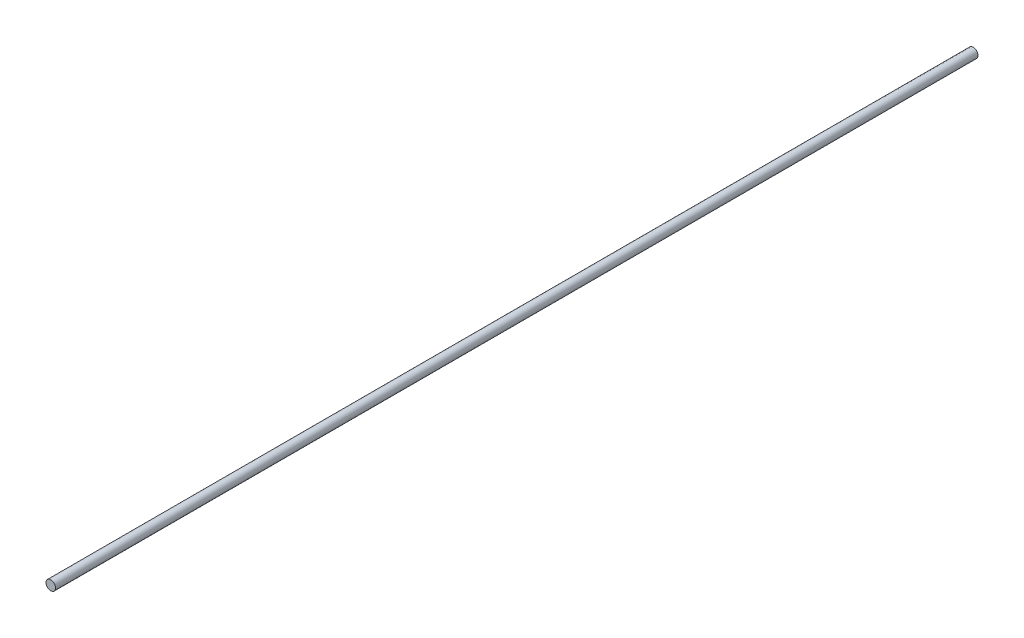
ISO-10303-21;
HEADER;
FILE_DESCRIPTION(('STEP AP214'),'2;1');
FILE_NAME('part.step','',(''),(''),'','','');
FILE_SCHEMA(('AUTOMOTIVE_DESIGN { 1 0 10303 214 1 1 1 1 }'));
ENDSEC;
DATA;
#1=APPLICATION_CONTEXT('core data for automotive mechanical design processes');
#2=APPLICATION_PROTOCOL_DEFINITION('international standard','automotive_design',2000,#1);
#3=PRODUCT_CONTEXT('',#1,'mechanical');
#4=PRODUCT('Part','Part','',(#3));
#5=PRODUCT_RELATED_PRODUCT_CATEGORY('part','',(#4));
#6=PRODUCT_DEFINITION_FORMATION('','',#4);
#7=PRODUCT_DEFINITION_CONTEXT('part definition',#1,'design');
#8=PRODUCT_DEFINITION('design','',#6,#7);
#9=PRODUCT_DEFINITION_SHAPE('','',#8);
#10=(LENGTH_UNIT() NAMED_UNIT(*) SI_UNIT(.MILLI.,.METRE.));
#11=(NAMED_UNIT(*) PLANE_ANGLE_UNIT() SI_UNIT($,.RADIAN.));
#12=(NAMED_UNIT(*) SI_UNIT($,.STERADIAN.) SOLID_ANGLE_UNIT());
#13=UNCERTAINTY_MEASURE_WITH_UNIT(LENGTH_MEASURE(1.E-05),#10,'distance_accuracy_value','');
#14=(GEOMETRIC_REPRESENTATION_CONTEXT(3) GLOBAL_UNCERTAINTY_ASSIGNED_CONTEXT((#13)) GLOBAL_UNIT_ASSIGNED_CONTEXT((#10,
#11,#12)) REPRESENTATION_CONTEXT('',''));
#15=CARTESIAN_POINT('',(0.,0.,0.));
#16=DIRECTION('',(0.,0.,1.));
#17=DIRECTION('',(1.,0.,0.));
#18=AXIS2_PLACEMENT_3D('',#15,#16,#17);
#19=CARTESIAN_POINT('',(0.,0.,307.34));
#20=DIRECTION('',(0.,0.,-1.));
#21=DIRECTION('',(-1.,0.,0.));
#22=AXIS2_PLACEMENT_3D('',#19,#20,#21);
#23=CYLINDRICAL_SURFACE('',#22,3.175);
#24=CARTESIAN_POINT('',(0.,0.,307.34));
#25=DIRECTION('',(0.,0.,1.));
#26=DIRECTION('',(1.,0.,0.));
#27=AXIS2_PLACEMENT_3D('',#24,#25,#26);
#28=CIRCLE('',#27,3.175);
#29=CARTESIAN_POINT('',(3.175,0.,307.34));
#30=VERTEX_POINT('',#29);
#31=EDGE_CURVE('E10',#30,#30,#28,.T.);
#32=ORIENTED_EDGE('',*,*,#31,.F.);
#33=EDGE_LOOP('',(#32));
#34=FACE_BOUND('',#33,.T.);
#35=CARTESIAN_POINT('',(0.,0.,-307.34));
#36=DIRECTION('',(0.,0.,1.));
#37=DIRECTION('',(1.,0.,0.));
#38=AXIS2_PLACEMENT_3D('',#35,#36,#37);
#39=CIRCLE('',#38,3.175);
#40=CARTESIAN_POINT('',(3.175,0.,-307.34));
#41=VERTEX_POINT('',#40);
#42=EDGE_CURVE('E37',#41,#41,#39,.T.);
#43=ORIENTED_EDGE('',*,*,#42,.T.);
#44=EDGE_LOOP('',(#43));
#45=FACE_BOUND('',#44,.T.);
#46=ADVANCED_FACE('F34',(#34,#45),#23,.T.);
#47=CARTESIAN_POINT('',(0.,0.,307.34));
#48=DIRECTION('',(0.,0.,1.));
#49=DIRECTION('',(1.,0.,0.));
#50=AXIS2_PLACEMENT_3D('',#47,#48,#49);
#51=PLANE('',#50);
#52=ORIENTED_EDGE('',*,*,#31,.T.);
#53=EDGE_LOOP('',(#52));
#54=FACE_BOUND('',#53,.T.);
#55=ADVANCED_FACE('F49',(#54),#51,.T.);
#56=CARTESIAN_POINT('',(0.,0.,-307.34));
#57=DIRECTION('',(0.,0.,1.));
#58=DIRECTION('',(1.,0.,0.));
#59=AXIS2_PLACEMENT_3D('',#56,#57,#58);
#60=PLANE('',#59);
#61=ORIENTED_EDGE('',*,*,#42,.F.);
#62=EDGE_LOOP('',(#61));
#63=FACE_BOUND('',#62,.T.);
#64=ADVANCED_FACE('F47',(#63),#60,.F.);
#65=CLOSED_SHELL('',(#46,#55,#64));
#66=MANIFOLD_SOLID_BREP('B2',#65);
#67=ADVANCED_BREP_SHAPE_REPRESENTATION('',(#18,#66),#14);
#68=SHAPE_DEFINITION_REPRESENTATION(#9,#67);
ENDSEC;
END-ISO-10303-21;
